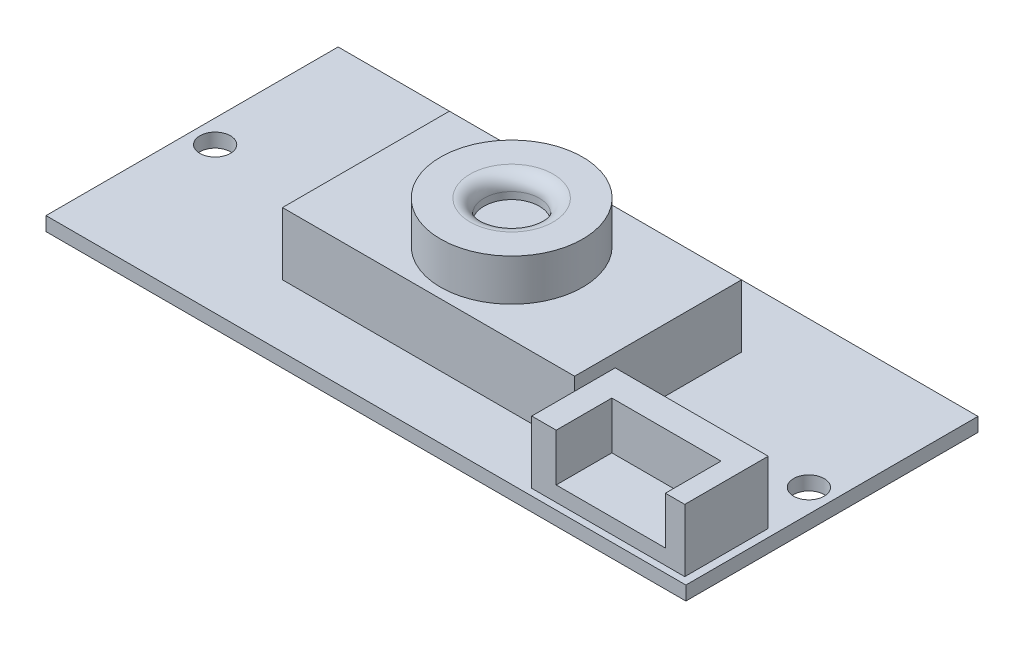
ISO-10303-21;
HEADER;
FILE_DESCRIPTION(('STEP AP214'),'2;1');
FILE_NAME('part.step','',(''),(''),'','','');
FILE_SCHEMA(('AUTOMOTIVE_DESIGN { 1 0 10303 214 1 1 1 1 }'));
ENDSEC;
DATA;
#1=APPLICATION_CONTEXT('core data for automotive mechanical design processes');
#2=APPLICATION_PROTOCOL_DEFINITION('international standard','automotive_design',2000,#1);
#3=PRODUCT_CONTEXT('',#1,'mechanical');
#4=PRODUCT('Part','Part','',(#3));
#5=PRODUCT_RELATED_PRODUCT_CATEGORY('part','',(#4));
#6=PRODUCT_DEFINITION_FORMATION('','',#4);
#7=PRODUCT_DEFINITION_CONTEXT('part definition',#1,'design');
#8=PRODUCT_DEFINITION('design','',#6,#7);
#9=PRODUCT_DEFINITION_SHAPE('','',#8);
#10=(LENGTH_UNIT() NAMED_UNIT(*) SI_UNIT(.MILLI.,.METRE.));
#11=(NAMED_UNIT(*) PLANE_ANGLE_UNIT() SI_UNIT($,.RADIAN.));
#12=(NAMED_UNIT(*) SI_UNIT($,.STERADIAN.) SOLID_ANGLE_UNIT());
#13=UNCERTAINTY_MEASURE_WITH_UNIT(LENGTH_MEASURE(1.E-05),#10,'distance_accuracy_value','');
#14=(GEOMETRIC_REPRESENTATION_CONTEXT(3) GLOBAL_UNCERTAINTY_ASSIGNED_CONTEXT((#13)) GLOBAL_UNIT_ASSIGNED_CONTEXT((#10,
#11,#12)) REPRESENTATION_CONTEXT('',''));
#15=CARTESIAN_POINT('',(0.,0.,0.));
#16=DIRECTION('',(0.,0.,1.));
#17=DIRECTION('',(1.,0.,0.));
#18=AXIS2_PLACEMENT_3D('',#15,#16,#17);
#19=CARTESIAN_POINT('',(0.,1.,0.));
#20=DIRECTION('',(0.,1.,0.));
#21=DIRECTION('',(0.,0.,1.));
#22=AXIS2_PLACEMENT_3D('',#19,#20,#21);
#23=PLANE('',#22);
#24=CARTESIAN_POINT('',(1.65816312177172,1.,10.5));
#25=DIRECTION('',(0.,1.,0.));
#26=DIRECTION('',(0.,0.,1.));
#27=AXIS2_PLACEMENT_3D('',#24,#25,#26);
#28=CIRCLE('',#27,1.1);
#29=CARTESIAN_POINT('',(1.65816312177172,1.,11.6));
#30=VERTEX_POINT('',#29);
#31=EDGE_CURVE('E290',#30,#30,#28,.T.);
#32=ORIENTED_EDGE('',*,*,#31,.F.);
#33=EDGE_LOOP('',(#32));
#34=FACE_BOUND('',#33,.T.);
#35=CARTESIAN_POINT('',(44.3418368782283,1.,10.5));
#36=DIRECTION('',(0.,1.,0.));
#37=DIRECTION('',(0.,0.,1.));
#38=AXIS2_PLACEMENT_3D('',#35,#36,#37);
#39=CIRCLE('',#38,1.1);
#40=CARTESIAN_POINT('',(44.3418368782283,1.,11.6));
#41=VERTEX_POINT('',#40);
#42=EDGE_CURVE('E296',#41,#41,#39,.T.);
#43=ORIENTED_EDGE('',*,*,#42,.F.);
#44=EDGE_LOOP('',(#43));
#45=FACE_BOUND('',#44,.T.);
#46=DIRECTION('',(0.,0.,1.));
#47=VECTOR('',#46,1.);
#48=CARTESIAN_POINT('',(12.5,1.,4.5));
#49=LINE('',#48,#47);
#50=CARTESIAN_POINT('',(12.5,1.,4.5));
#51=VERTEX_POINT('',#50);
#52=CARTESIAN_POINT('',(12.5,1.,16.5));
#53=VERTEX_POINT('',#52);
#54=EDGE_CURVE('E215',#51,#53,#49,.T.);
#55=ORIENTED_EDGE('',*,*,#54,.F.);
#56=DIRECTION('',(-1.,0.,0.));
#57=VECTOR('',#56,1.);
#58=CARTESIAN_POINT('',(12.5,1.,4.5));
#59=LINE('',#58,#57);
#60=CARTESIAN_POINT('',(33.5,1.,4.5));
#61=VERTEX_POINT('',#60);
#62=EDGE_CURVE('E229',#61,#51,#59,.T.);
#63=ORIENTED_EDGE('',*,*,#62,.F.);
#64=DIRECTION('',(0.,0.,-1.));
#65=VECTOR('',#64,1.);
#66=CARTESIAN_POINT('',(33.5,1.,4.5));
#67=LINE('',#66,#65);
#68=CARTESIAN_POINT('',(33.5,1.,16.5));
#69=VERTEX_POINT('',#68);
#70=EDGE_CURVE('E241',#69,#61,#67,.T.);
#71=ORIENTED_EDGE('',*,*,#70,.F.);
#72=DIRECTION('',(1.,0.,0.));
#73=VECTOR('',#72,1.);
#74=CARTESIAN_POINT('',(12.5,1.,16.5));
#75=LINE('',#74,#73);
#76=EDGE_CURVE('E238',#53,#69,#75,.T.);
#77=ORIENTED_EDGE('',*,*,#76,.F.);
#78=EDGE_LOOP('',(#55,#63,#71,#77));
#79=FACE_BOUND('',#78,.T.);
#80=DIRECTION('',(0.,0.,1.));
#81=VECTOR('',#80,1.);
#82=CARTESIAN_POINT('',(0.,1.,0.));
#83=LINE('',#82,#81);
#84=CARTESIAN_POINT('',(0.,1.,0.));
#85=VERTEX_POINT('',#84);
#86=CARTESIAN_POINT('',(0.,1.,21.));
#87=VERTEX_POINT('',#86);
#88=EDGE_CURVE('E258',#85,#87,#83,.T.);
#89=ORIENTED_EDGE('',*,*,#88,.T.);
#90=DIRECTION('',(1.,0.,0.));
#91=VECTOR('',#90,1.);
#92=CARTESIAN_POINT('',(0.,1.,21.));
#93=LINE('',#92,#91);
#94=CARTESIAN_POINT('',(46.,1.,21.));
#95=VERTEX_POINT('',#94);
#96=EDGE_CURVE('E261',#87,#95,#93,.T.);
#97=ORIENTED_EDGE('',*,*,#96,.T.);
#98=DIRECTION('',(0.,0.,-1.));
#99=VECTOR('',#98,1.);
#100=CARTESIAN_POINT('',(46.,1.,0.));
#101=LINE('',#100,#99);
#102=CARTESIAN_POINT('',(46.,1.,0.));
#103=VERTEX_POINT('',#102);
#104=EDGE_CURVE('E264',#95,#103,#101,.T.);
#105=ORIENTED_EDGE('',*,*,#104,.T.);
#106=DIRECTION('',(-1.,0.,0.));
#107=VECTOR('',#106,1.);
#108=CARTESIAN_POINT('',(0.,1.,0.));
#109=LINE('',#108,#107);
#110=EDGE_CURVE('E266',#103,#85,#109,.T.);
#111=ORIENTED_EDGE('',*,*,#110,.T.);
#112=EDGE_LOOP('',(#89,#97,#105,#111));
#113=FACE_BOUND('',#112,.T.);
#114=DIRECTION('',(1.,0.,0.));
#115=VECTOR('',#114,1.);
#116=CARTESIAN_POINT('',(34.4395808594965,1.,20.5204812635652));
#117=LINE('',#116,#115);
#118=CARTESIAN_POINT('',(34.4395808594965,1.,20.5204812635652));
#119=VERTEX_POINT('',#118);
#120=CARTESIAN_POINT('',(45.4395808594966,1.,20.5204812635652));
#121=VERTEX_POINT('',#120);
#122=EDGE_CURVE('E210',#119,#121,#117,.T.);
#123=ORIENTED_EDGE('',*,*,#122,.F.);
#124=DIRECTION('',(0.,0.,1.));
#125=VECTOR('',#124,1.);
#126=CARTESIAN_POINT('',(34.4395808594965,1.,14.5204812635652));
#127=LINE('',#126,#125);
#128=CARTESIAN_POINT('',(34.4395808594965,1.,14.5204812635652));
#129=VERTEX_POINT('',#128);
#130=EDGE_CURVE('E212',#129,#119,#127,.T.);
#131=ORIENTED_EDGE('',*,*,#130,.F.);
#132=DIRECTION('',(-1.,0.,0.));
#133=VECTOR('',#132,1.);
#134=CARTESIAN_POINT('',(34.4395808594965,1.,14.5204812635652));
#135=LINE('',#134,#133);
#136=CARTESIAN_POINT('',(45.4395808594966,1.,14.5204812635652));
#137=VERTEX_POINT('',#136);
#138=EDGE_CURVE('E205',#137,#129,#135,.T.);
#139=ORIENTED_EDGE('',*,*,#138,.F.);
#140=DIRECTION('',(0.,0.,-1.));
#141=VECTOR('',#140,1.);
#142=CARTESIAN_POINT('',(45.4395808594966,1.,14.5204812635652));
#143=LINE('',#142,#141);
#144=EDGE_CURVE('E207',#121,#137,#143,.T.);
#145=ORIENTED_EDGE('',*,*,#144,.F.);
#146=EDGE_LOOP('',(#123,#131,#139,#145));
#147=FACE_BOUND('',#146,.T.);
#148=ADVANCED_FACE('F40',(#34,#45,#79,#113,#147),#23,.T.);
#149=CARTESIAN_POINT('',(0.,1.,0.));
#150=DIRECTION('',(1.,0.,0.));
#151=DIRECTION('',(0.,0.,-1.));
#152=AXIS2_PLACEMENT_3D('',#149,#150,#151);
#153=PLANE('',#152);
#154=DIRECTION('',(0.,0.,1.));
#155=VECTOR('',#154,1.);
#156=CARTESIAN_POINT('',(0.,0.,0.));
#157=LINE('',#156,#155);
#158=CARTESIAN_POINT('',(0.,0.,0.));
#159=VERTEX_POINT('',#158);
#160=CARTESIAN_POINT('',(0.,0.,21.));
#161=VERTEX_POINT('',#160);
#162=EDGE_CURVE('E257',#159,#161,#157,.T.);
#163=ORIENTED_EDGE('',*,*,#162,.T.);
#164=DIRECTION('',(0.,-1.,0.));
#165=VECTOR('',#164,1.);
#166=CARTESIAN_POINT('',(0.,1.,21.));
#167=LINE('',#166,#165);
#168=EDGE_CURVE('E284',#87,#161,#167,.T.);
#169=ORIENTED_EDGE('',*,*,#168,.F.);
#170=ORIENTED_EDGE('',*,*,#88,.F.);
#171=DIRECTION('',(0.,-1.,0.));
#172=VECTOR('',#171,1.);
#173=CARTESIAN_POINT('',(0.,1.,0.));
#174=LINE('',#173,#172);
#175=EDGE_CURVE('E268',#85,#159,#174,.T.);
#176=ORIENTED_EDGE('',*,*,#175,.T.);
#177=EDGE_LOOP('',(#163,#169,#170,#176));
#178=FACE_BOUND('',#177,.T.);
#179=ADVANCED_FACE('F339',(#178),#153,.F.);
#180=CARTESIAN_POINT('',(0.,1.,21.));
#181=DIRECTION('',(0.,0.,-1.));
#182=DIRECTION('',(-1.,0.,0.));
#183=AXIS2_PLACEMENT_3D('',#180,#181,#182);
#184=PLANE('',#183);
#185=DIRECTION('',(1.,0.,0.));
#186=VECTOR('',#185,1.);
#187=CARTESIAN_POINT('',(0.,0.,21.));
#188=LINE('',#187,#186);
#189=CARTESIAN_POINT('',(46.,0.,21.));
#190=VERTEX_POINT('',#189);
#191=EDGE_CURVE('E271',#161,#190,#188,.T.);
#192=ORIENTED_EDGE('',*,*,#191,.T.);
#193=DIRECTION('',(0.,-1.,0.));
#194=VECTOR('',#193,1.);
#195=CARTESIAN_POINT('',(46.,1.,21.));
#196=LINE('',#195,#194);
#197=EDGE_CURVE('E281',#95,#190,#196,.T.);
#198=ORIENTED_EDGE('',*,*,#197,.F.);
#199=ORIENTED_EDGE('',*,*,#96,.F.);
#200=ORIENTED_EDGE('',*,*,#168,.T.);
#201=EDGE_LOOP('',(#192,#198,#199,#200));
#202=FACE_BOUND('',#201,.T.);
#203=ADVANCED_FACE('F395',(#202),#184,.F.);
#204=CARTESIAN_POINT('',(46.,1.,0.));
#205=DIRECTION('',(-1.,0.,0.));
#206=DIRECTION('',(0.,0.,1.));
#207=AXIS2_PLACEMENT_3D('',#204,#205,#206);
#208=PLANE('',#207);
#209=DIRECTION('',(0.,0.,-1.));
#210=VECTOR('',#209,1.);
#211=CARTESIAN_POINT('',(46.,0.,0.));
#212=LINE('',#211,#210);
#213=CARTESIAN_POINT('',(46.,0.,0.));
#214=VERTEX_POINT('',#213);
#215=EDGE_CURVE('E273',#190,#214,#212,.T.);
#216=ORIENTED_EDGE('',*,*,#215,.T.);
#217=DIRECTION('',(0.,-1.,0.));
#218=VECTOR('',#217,1.);
#219=CARTESIAN_POINT('',(46.,1.,0.));
#220=LINE('',#219,#218);
#221=EDGE_CURVE('E278',#103,#214,#220,.T.);
#222=ORIENTED_EDGE('',*,*,#221,.F.);
#223=ORIENTED_EDGE('',*,*,#104,.F.);
#224=ORIENTED_EDGE('',*,*,#197,.T.);
#225=EDGE_LOOP('',(#216,#222,#223,#224));
#226=FACE_BOUND('',#225,.T.);
#227=ADVANCED_FACE('F391',(#226),#208,.F.);
#228=CARTESIAN_POINT('',(0.,1.,0.));
#229=DIRECTION('',(0.,0.,1.));
#230=DIRECTION('',(1.,0.,0.));
#231=AXIS2_PLACEMENT_3D('',#228,#229,#230);
#232=PLANE('',#231);
#233=DIRECTION('',(-1.,0.,0.));
#234=VECTOR('',#233,1.);
#235=CARTESIAN_POINT('',(0.,0.,0.));
#236=LINE('',#235,#234);
#237=EDGE_CURVE('E262',#214,#159,#236,.T.);
#238=ORIENTED_EDGE('',*,*,#237,.T.);
#239=ORIENTED_EDGE('',*,*,#175,.F.);
#240=ORIENTED_EDGE('',*,*,#110,.F.);
#241=ORIENTED_EDGE('',*,*,#221,.T.);
#242=EDGE_LOOP('',(#238,#239,#240,#241));
#243=FACE_BOUND('',#242,.T.);
#244=ADVANCED_FACE('F387',(#243),#232,.F.);
#245=CARTESIAN_POINT('',(0.,0.,0.));
#246=DIRECTION('',(0.,1.,0.));
#247=DIRECTION('',(0.,0.,1.));
#248=AXIS2_PLACEMENT_3D('',#245,#246,#247);
#249=PLANE('',#248);
#250=CARTESIAN_POINT('',(1.65816312177172,0.,10.5));
#251=DIRECTION('',(0.,1.,0.));
#252=DIRECTION('',(0.,0.,1.));
#253=AXIS2_PLACEMENT_3D('',#250,#251,#252);
#254=CIRCLE('',#253,1.1);
#255=CARTESIAN_POINT('',(1.65816312177172,0.,11.6));
#256=VERTEX_POINT('',#255);
#257=EDGE_CURVE('E44',#256,#256,#254,.T.);
#258=ORIENTED_EDGE('',*,*,#257,.T.);
#259=EDGE_LOOP('',(#258));
#260=FACE_BOUND('',#259,.T.);
#261=CARTESIAN_POINT('',(44.3418368782283,0.,10.5));
#262=DIRECTION('',(0.,1.,0.));
#263=DIRECTION('',(0.,0.,1.));
#264=AXIS2_PLACEMENT_3D('',#261,#262,#263);
#265=CIRCLE('',#264,1.1);
#266=CARTESIAN_POINT('',(44.3418368782283,0.,11.6));
#267=VERTEX_POINT('',#266);
#268=EDGE_CURVE('E288',#267,#267,#265,.T.);
#269=ORIENTED_EDGE('',*,*,#268,.T.);
#270=EDGE_LOOP('',(#269));
#271=FACE_BOUND('',#270,.T.);
#272=ORIENTED_EDGE('',*,*,#162,.F.);
#273=ORIENTED_EDGE('',*,*,#237,.F.);
#274=ORIENTED_EDGE('',*,*,#215,.F.);
#275=ORIENTED_EDGE('',*,*,#191,.F.);
#276=EDGE_LOOP('',(#272,#273,#274,#275));
#277=FACE_BOUND('',#276,.T.);
#278=ADVANCED_FACE('F383',(#260,#271,#277),#249,.F.);
#279=CARTESIAN_POINT('',(12.5,5.5,4.5));
#280=DIRECTION('',(1.,0.,0.));
#281=DIRECTION('',(0.,0.,-1.));
#282=AXIS2_PLACEMENT_3D('',#279,#280,#281);
#283=PLANE('',#282);
#284=ORIENTED_EDGE('',*,*,#54,.T.);
#285=DIRECTION('',(0.,-1.,0.));
#286=VECTOR('',#285,1.);
#287=CARTESIAN_POINT('',(12.5,5.5,16.5));
#288=LINE('',#287,#286);
#289=CARTESIAN_POINT('',(12.5,5.5,16.5));
#290=VERTEX_POINT('',#289);
#291=EDGE_CURVE('E254',#290,#53,#288,.T.);
#292=ORIENTED_EDGE('',*,*,#291,.F.);
#293=DIRECTION('',(0.,0.,1.));
#294=VECTOR('',#293,1.);
#295=CARTESIAN_POINT('',(12.5,5.5,4.5));
#296=LINE('',#295,#294);
#297=CARTESIAN_POINT('',(12.5,5.5,4.5));
#298=VERTEX_POINT('',#297);
#299=EDGE_CURVE('E225',#298,#290,#296,.T.);
#300=ORIENTED_EDGE('',*,*,#299,.F.);
#301=DIRECTION('',(0.,-1.,0.));
#302=VECTOR('',#301,1.);
#303=CARTESIAN_POINT('',(12.5,5.5,4.5));
#304=LINE('',#303,#302);
#305=EDGE_CURVE('E235',#298,#51,#304,.T.);
#306=ORIENTED_EDGE('',*,*,#305,.T.);
#307=EDGE_LOOP('',(#284,#292,#300,#306));
#308=FACE_BOUND('',#307,.T.);
#309=ADVANCED_FACE('F328',(#308),#283,.F.);
#310=CARTESIAN_POINT('',(12.5,5.5,16.5));
#311=DIRECTION('',(0.,0.,-1.));
#312=DIRECTION('',(-1.,0.,0.));
#313=AXIS2_PLACEMENT_3D('',#310,#311,#312);
#314=PLANE('',#313);
#315=ORIENTED_EDGE('',*,*,#76,.T.);
#316=DIRECTION('',(0.,-1.,0.));
#317=VECTOR('',#316,1.);
#318=CARTESIAN_POINT('',(33.5,5.5,16.5));
#319=LINE('',#318,#317);
#320=CARTESIAN_POINT('',(33.5,5.5,16.5));
#321=VERTEX_POINT('',#320);
#322=EDGE_CURVE('E251',#321,#69,#319,.T.);
#323=ORIENTED_EDGE('',*,*,#322,.F.);
#324=DIRECTION('',(1.,0.,0.));
#325=VECTOR('',#324,1.);
#326=CARTESIAN_POINT('',(12.5,5.5,16.5));
#327=LINE('',#326,#325);
#328=EDGE_CURVE('E228',#290,#321,#327,.T.);
#329=ORIENTED_EDGE('',*,*,#328,.F.);
#330=ORIENTED_EDGE('',*,*,#291,.T.);
#331=EDGE_LOOP('',(#315,#323,#329,#330));
#332=FACE_BOUND('',#331,.T.);
#333=ADVANCED_FACE('F330',(#332),#314,.F.);
#334=CARTESIAN_POINT('',(33.5,5.5,4.5));
#335=DIRECTION('',(-1.,0.,0.));
#336=DIRECTION('',(0.,0.,1.));
#337=AXIS2_PLACEMENT_3D('',#334,#335,#336);
#338=PLANE('',#337);
#339=ORIENTED_EDGE('',*,*,#70,.T.);
#340=DIRECTION('',(0.,-1.,0.));
#341=VECTOR('',#340,1.);
#342=CARTESIAN_POINT('',(33.5,5.5,4.5));
#343=LINE('',#342,#341);
#344=CARTESIAN_POINT('',(33.5,5.5,4.5));
#345=VERTEX_POINT('',#344);
#346=EDGE_CURVE('E248',#345,#61,#343,.T.);
#347=ORIENTED_EDGE('',*,*,#346,.F.);
#348=DIRECTION('',(0.,0.,-1.));
#349=VECTOR('',#348,1.);
#350=CARTESIAN_POINT('',(33.5,5.5,4.5));
#351=LINE('',#350,#349);
#352=EDGE_CURVE('E231',#321,#345,#351,.T.);
#353=ORIENTED_EDGE('',*,*,#352,.F.);
#354=ORIENTED_EDGE('',*,*,#322,.T.);
#355=EDGE_LOOP('',(#339,#347,#353,#354));
#356=FACE_BOUND('',#355,.T.);
#357=ADVANCED_FACE('F334',(#356),#338,.F.);
#358=CARTESIAN_POINT('',(12.5,5.5,4.5));
#359=DIRECTION('',(0.,0.,1.));
#360=DIRECTION('',(1.,0.,0.));
#361=AXIS2_PLACEMENT_3D('',#358,#359,#360);
#362=PLANE('',#361);
#363=ORIENTED_EDGE('',*,*,#62,.T.);
#364=ORIENTED_EDGE('',*,*,#305,.F.);
#365=DIRECTION('',(-1.,0.,0.));
#366=VECTOR('',#365,1.);
#367=CARTESIAN_POINT('',(12.5,5.5,4.5));
#368=LINE('',#367,#366);
#369=EDGE_CURVE('E233',#345,#298,#368,.T.);
#370=ORIENTED_EDGE('',*,*,#369,.F.);
#371=ORIENTED_EDGE('',*,*,#346,.T.);
#372=EDGE_LOOP('',(#363,#364,#370,#371));
#373=FACE_BOUND('',#372,.T.);
#374=ADVANCED_FACE('F320',(#373),#362,.F.);
#375=CARTESIAN_POINT('',(0.,5.5,0.));
#376=DIRECTION('',(0.,1.,0.));
#377=DIRECTION('',(0.,0.,1.));
#378=AXIS2_PLACEMENT_3D('',#375,#376,#377);
#379=PLANE('',#378);
#380=CARTESIAN_POINT('',(23.1471850819188,5.5,10.6717159289053));
#381=DIRECTION('',(0.,1.,0.));
#382=DIRECTION('',(0.,0.,1.));
#383=AXIS2_PLACEMENT_3D('',#380,#381,#382);
#384=CIRCLE('',#383,5.10925192655788);
#385=CARTESIAN_POINT('',(23.1471850819188,5.5,15.7809678554631));
#386=VERTEX_POINT('',#385);
#387=EDGE_CURVE('E181',#386,#386,#384,.T.);
#388=ORIENTED_EDGE('',*,*,#387,.F.);
#389=EDGE_LOOP('',(#388));
#390=FACE_BOUND('',#389,.T.);
#391=ORIENTED_EDGE('',*,*,#299,.T.);
#392=ORIENTED_EDGE('',*,*,#328,.T.);
#393=ORIENTED_EDGE('',*,*,#352,.T.);
#394=ORIENTED_EDGE('',*,*,#369,.T.);
#395=EDGE_LOOP('',(#391,#392,#393,#394));
#396=FACE_BOUND('',#395,.T.);
#397=ADVANCED_FACE('F316',(#390,#396),#379,.T.);
#398=CARTESIAN_POINT('',(34.4395808594965,5.5,14.5204812635652));
#399=DIRECTION('',(1.,0.,0.));
#400=DIRECTION('',(0.,0.,-1.));
#401=AXIS2_PLACEMENT_3D('',#398,#399,#400);
#402=PLANE('',#401);
#403=ORIENTED_EDGE('',*,*,#130,.T.);
#404=DIRECTION('',(0.,-1.,0.));
#405=VECTOR('',#404,1.);
#406=CARTESIAN_POINT('',(34.4395808594965,5.5,20.5204812635652));
#407=LINE('',#406,#405);
#408=CARTESIAN_POINT('',(34.4395808594965,5.5,20.5204812635652));
#409=VERTEX_POINT('',#408);
#410=EDGE_CURVE('E191',#409,#119,#407,.T.);
#411=ORIENTED_EDGE('',*,*,#410,.F.);
#412=DIRECTION('',(0.,0.,1.));
#413=VECTOR('',#412,1.);
#414=CARTESIAN_POINT('',(34.4395808594965,5.5,14.5204812635652));
#415=LINE('',#414,#413);
#416=CARTESIAN_POINT('',(34.4395808594965,5.5,14.5204812635652));
#417=VERTEX_POINT('',#416);
#418=EDGE_CURVE('E208',#417,#409,#415,.T.);
#419=ORIENTED_EDGE('',*,*,#418,.F.);
#420=DIRECTION('',(0.,-1.,0.));
#421=VECTOR('',#420,1.);
#422=CARTESIAN_POINT('',(34.4395808594965,5.5,14.5204812635652));
#423=LINE('',#422,#421);
#424=EDGE_CURVE('E201',#417,#129,#423,.T.);
#425=ORIENTED_EDGE('',*,*,#424,.T.);
#426=EDGE_LOOP('',(#403,#411,#419,#425));
#427=FACE_BOUND('',#426,.T.);
#428=ADVANCED_FACE('F319',(#427),#402,.F.);
#429=CARTESIAN_POINT('',(34.4395808594965,5.5,20.5204812635652));
#430=DIRECTION('',(0.,0.,-1.));
#431=DIRECTION('',(-1.,0.,0.));
#432=AXIS2_PLACEMENT_3D('',#429,#430,#431);
#433=PLANE('',#432);
#434=DIRECTION('',(1.,0.,0.));
#435=VECTOR('',#434,1.);
#436=CARTESIAN_POINT('',(36.1975956787205,2.0876671313654,20.5204812635652));
#437=LINE('',#436,#435);
#438=CARTESIAN_POINT('',(36.1975956787205,2.0876671313654,20.5204812635652));
#439=VERTEX_POINT('',#438);
#440=CARTESIAN_POINT('',(44.0474667143907,2.0876671313654,20.5204812635652));
#441=VERTEX_POINT('',#440);
#442=EDGE_CURVE('E178',#439,#441,#437,.T.);
#443=ORIENTED_EDGE('',*,*,#442,.F.);
#444=DIRECTION('',(0.,-1.,0.));
#445=VECTOR('',#444,1.);
#446=CARTESIAN_POINT('',(36.1975956787205,5.5,20.5204812635652));
#447=LINE('',#446,#445);
#448=CARTESIAN_POINT('',(36.1975956787205,5.5,20.5204812635652));
#449=VERTEX_POINT('',#448);
#450=EDGE_CURVE('E163',#449,#439,#447,.T.);
#451=ORIENTED_EDGE('',*,*,#450,.F.);
#452=DIRECTION('',(1.,0.,0.));
#453=VECTOR('',#452,1.);
#454=CARTESIAN_POINT('',(34.4395808594965,5.5,20.5204812635652));
#455=LINE('',#454,#453);
#456=EDGE_CURVE('E220',#409,#449,#455,.T.);
#457=ORIENTED_EDGE('',*,*,#456,.F.);
#458=ORIENTED_EDGE('',*,*,#410,.T.);
#459=ORIENTED_EDGE('',*,*,#122,.T.);
#460=DIRECTION('',(0.,-1.,0.));
#461=VECTOR('',#460,1.);
#462=CARTESIAN_POINT('',(45.4395808594966,5.5,20.5204812635652));
#463=LINE('',#462,#461);
#464=CARTESIAN_POINT('',(45.4395808594966,5.5,20.5204812635652));
#465=VERTEX_POINT('',#464);
#466=EDGE_CURVE('E197',#465,#121,#463,.T.);
#467=ORIENTED_EDGE('',*,*,#466,.F.);
#468=CARTESIAN_POINT('',(44.0474667143907,5.5,20.5204812635652));
#469=VERTEX_POINT('',#468);
#470=EDGE_CURVE('E219',#469,#465,#455,.T.);
#471=ORIENTED_EDGE('',*,*,#470,.F.);
#472=DIRECTION('',(0.,1.,0.));
#473=VECTOR('',#472,1.);
#474=CARTESIAN_POINT('',(44.0474667143907,5.5,20.5204812635652));
#475=LINE('',#474,#473);
#476=EDGE_CURVE('E176',#441,#469,#475,.T.);
#477=ORIENTED_EDGE('',*,*,#476,.F.);
#478=EDGE_LOOP('',(#443,#451,#457,#458,#459,#467,#471,#477));
#479=FACE_BOUND('',#478,.T.);
#480=ADVANCED_FACE('F351',(#479),#433,.F.);
#481=CARTESIAN_POINT('',(45.4395808594966,5.5,14.5204812635652));
#482=DIRECTION('',(-1.,0.,0.));
#483=DIRECTION('',(0.,0.,1.));
#484=AXIS2_PLACEMENT_3D('',#481,#482,#483);
#485=PLANE('',#484);
#486=ORIENTED_EDGE('',*,*,#144,.T.);
#487=DIRECTION('',(0.,-1.,0.));
#488=VECTOR('',#487,1.);
#489=CARTESIAN_POINT('',(45.4395808594966,5.5,14.5204812635652));
#490=LINE('',#489,#488);
#491=CARTESIAN_POINT('',(45.4395808594966,5.5,14.5204812635652));
#492=VERTEX_POINT('',#491);
#493=EDGE_CURVE('E65',#492,#137,#490,.T.);
#494=ORIENTED_EDGE('',*,*,#493,.F.);
#495=DIRECTION('',(0.,0.,-1.));
#496=VECTOR('',#495,1.);
#497=CARTESIAN_POINT('',(45.4395808594966,5.5,14.5204812635652));
#498=LINE('',#497,#496);
#499=EDGE_CURVE('E217',#465,#492,#498,.T.);
#500=ORIENTED_EDGE('',*,*,#499,.F.);
#501=ORIENTED_EDGE('',*,*,#466,.T.);
#502=EDGE_LOOP('',(#486,#494,#500,#501));
#503=FACE_BOUND('',#502,.T.);
#504=ADVANCED_FACE('F356',(#503),#485,.F.);
#505=CARTESIAN_POINT('',(34.4395808594965,5.5,14.5204812635652));
#506=DIRECTION('',(0.,0.,1.));
#507=DIRECTION('',(1.,0.,0.));
#508=AXIS2_PLACEMENT_3D('',#505,#506,#507);
#509=PLANE('',#508);
#510=ORIENTED_EDGE('',*,*,#138,.T.);
#511=ORIENTED_EDGE('',*,*,#424,.F.);
#512=DIRECTION('',(-1.,0.,0.));
#513=VECTOR('',#512,1.);
#514=CARTESIAN_POINT('',(34.4395808594965,5.5,14.5204812635652));
#515=LINE('',#514,#513);
#516=EDGE_CURVE('E204',#492,#417,#515,.T.);
#517=ORIENTED_EDGE('',*,*,#516,.F.);
#518=ORIENTED_EDGE('',*,*,#493,.T.);
#519=EDGE_LOOP('',(#510,#511,#517,#518));
#520=FACE_BOUND('',#519,.T.);
#521=ADVANCED_FACE('F365',(#520),#509,.F.);
#522=CARTESIAN_POINT('',(0.,5.5,0.));
#523=DIRECTION('',(0.,1.,0.));
#524=DIRECTION('',(0.,0.,1.));
#525=AXIS2_PLACEMENT_3D('',#522,#523,#524);
#526=PLANE('',#525);
#527=DIRECTION('',(0.,0.,1.));
#528=VECTOR('',#527,1.);
#529=CARTESIAN_POINT('',(36.1975956787205,5.5,16.5204812635652));
#530=LINE('',#529,#528);
#531=CARTESIAN_POINT('',(36.1975956787205,5.5,16.5204812635652));
#532=VERTEX_POINT('',#531);
#533=EDGE_CURVE('E189',#532,#449,#530,.T.);
#534=ORIENTED_EDGE('',*,*,#533,.F.);
#535=DIRECTION('',(-1.,0.,0.));
#536=VECTOR('',#535,1.);
#537=CARTESIAN_POINT('',(36.1975956787205,5.5,16.5204812635652));
#538=LINE('',#537,#536);
#539=CARTESIAN_POINT('',(44.0474667143907,5.5,16.5204812635652));
#540=VERTEX_POINT('',#539);
#541=EDGE_CURVE('E168',#540,#532,#538,.T.);
#542=ORIENTED_EDGE('',*,*,#541,.F.);
#543=DIRECTION('',(0.,0.,1.));
#544=VECTOR('',#543,1.);
#545=CARTESIAN_POINT('',(44.0474667143907,5.5,16.5204812635652));
#546=LINE('',#545,#544);
#547=EDGE_CURVE('E192',#540,#469,#546,.T.);
#548=ORIENTED_EDGE('',*,*,#547,.T.);
#549=ORIENTED_EDGE('',*,*,#470,.T.);
#550=ORIENTED_EDGE('',*,*,#499,.T.);
#551=ORIENTED_EDGE('',*,*,#516,.T.);
#552=ORIENTED_EDGE('',*,*,#418,.T.);
#553=ORIENTED_EDGE('',*,*,#456,.T.);
#554=EDGE_LOOP('',(#534,#542,#548,#549,#550,#551,#552,#553));
#555=FACE_BOUND('',#554,.T.);
#556=ADVANCED_FACE('F358',(#555),#526,.T.);
#557=CARTESIAN_POINT('',(36.1975956787205,5.5,16.5204812635652));
#558=DIRECTION('',(-1.,0.,0.));
#559=DIRECTION('',(0.,0.,1.));
#560=AXIS2_PLACEMENT_3D('',#557,#558,#559);
#561=PLANE('',#560);
#562=ORIENTED_EDGE('',*,*,#450,.T.);
#563=DIRECTION('',(0.,0.,1.));
#564=VECTOR('',#563,1.);
#565=CARTESIAN_POINT('',(36.1975956787205,2.0876671313654,16.5204812635652));
#566=LINE('',#565,#564);
#567=CARTESIAN_POINT('',(36.1975956787205,2.0876671313654,16.5204812635652));
#568=VERTEX_POINT('',#567);
#569=EDGE_CURVE('E157',#568,#439,#566,.T.);
#570=ORIENTED_EDGE('',*,*,#569,.F.);
#571=DIRECTION('',(0.,-1.,0.));
#572=VECTOR('',#571,1.);
#573=CARTESIAN_POINT('',(36.1975956787205,5.5,16.5204812635652));
#574=LINE('',#573,#572);
#575=EDGE_CURVE('E161',#532,#568,#574,.T.);
#576=ORIENTED_EDGE('',*,*,#575,.F.);
#577=ORIENTED_EDGE('',*,*,#533,.T.);
#578=EDGE_LOOP('',(#562,#570,#576,#577));
#579=FACE_BOUND('',#578,.T.);
#580=ADVANCED_FACE('F159',(#579),#561,.F.);
#581=CARTESIAN_POINT('',(44.0474667143907,5.5,16.5204812635652));
#582=DIRECTION('',(1.,0.,0.));
#583=DIRECTION('',(0.,0.,-1.));
#584=AXIS2_PLACEMENT_3D('',#581,#582,#583);
#585=PLANE('',#584);
#586=ORIENTED_EDGE('',*,*,#476,.T.);
#587=ORIENTED_EDGE('',*,*,#547,.F.);
#588=DIRECTION('',(0.,1.,0.));
#589=VECTOR('',#588,1.);
#590=CARTESIAN_POINT('',(44.0474667143907,5.5,16.5204812635652));
#591=LINE('',#590,#589);
#592=CARTESIAN_POINT('',(44.0474667143907,2.0876671313654,16.5204812635652));
#593=VERTEX_POINT('',#592);
#594=EDGE_CURVE('E57',#593,#540,#591,.T.);
#595=ORIENTED_EDGE('',*,*,#594,.F.);
#596=DIRECTION('',(0.,0.,1.));
#597=VECTOR('',#596,1.);
#598=CARTESIAN_POINT('',(44.0474667143907,2.0876671313654,16.5204812635652));
#599=LINE('',#598,#597);
#600=EDGE_CURVE('E167',#593,#441,#599,.T.);
#601=ORIENTED_EDGE('',*,*,#600,.T.);
#602=EDGE_LOOP('',(#586,#587,#595,#601));
#603=FACE_BOUND('',#602,.T.);
#604=ADVANCED_FACE('F362',(#603),#585,.F.);
#605=CARTESIAN_POINT('',(36.1975956787205,2.0876671313654,16.5204812635652));
#606=DIRECTION('',(0.,-1.,0.));
#607=DIRECTION('',(0.,0.,-1.));
#608=AXIS2_PLACEMENT_3D('',#605,#606,#607);
#609=PLANE('',#608);
#610=ORIENTED_EDGE('',*,*,#442,.T.);
#611=ORIENTED_EDGE('',*,*,#600,.F.);
#612=DIRECTION('',(1.,0.,0.));
#613=VECTOR('',#612,1.);
#614=CARTESIAN_POINT('',(36.1975956787205,2.0876671313654,16.5204812635652));
#615=LINE('',#614,#613);
#616=EDGE_CURVE('E170',#568,#593,#615,.T.);
#617=ORIENTED_EDGE('',*,*,#616,.F.);
#618=ORIENTED_EDGE('',*,*,#569,.T.);
#619=EDGE_LOOP('',(#610,#611,#617,#618));
#620=FACE_BOUND('',#619,.T.);
#621=ADVANCED_FACE('F171',(#620),#609,.F.);
#622=CARTESIAN_POINT('',(0.,0.,16.5204812635652));
#623=DIRECTION('',(0.,0.,1.));
#624=DIRECTION('',(1.,0.,0.));
#625=AXIS2_PLACEMENT_3D('',#622,#623,#624);
#626=PLANE('',#625);
#627=ORIENTED_EDGE('',*,*,#575,.T.);
#628=ORIENTED_EDGE('',*,*,#616,.T.);
#629=ORIENTED_EDGE('',*,*,#594,.T.);
#630=ORIENTED_EDGE('',*,*,#541,.T.);
#631=EDGE_LOOP('',(#627,#628,#629,#630));
#632=FACE_BOUND('',#631,.T.);
#633=ADVANCED_FACE('F173',(#632),#626,.T.);
#634=CARTESIAN_POINT('',(23.1471850819188,8.5,10.6717159289053));
#635=DIRECTION('',(0.,-1.,0.));
#636=DIRECTION('',(0.,0.,-1.));
#637=AXIS2_PLACEMENT_3D('',#634,#635,#636);
#638=CYLINDRICAL_SURFACE('',#637,5.10925192655788);
#639=CARTESIAN_POINT('',(23.1471850819188,8.5,10.6717159289053));
#640=DIRECTION('',(0.,1.,0.));
#641=DIRECTION('',(0.,0.,1.));
#642=AXIS2_PLACEMENT_3D('',#639,#640,#641);
#643=CIRCLE('',#642,5.10925192655788);
#644=CARTESIAN_POINT('',(23.1471850819188,8.5,15.7809678554631));
#645=VERTEX_POINT('',#644);
#646=EDGE_CURVE('E187',#645,#645,#643,.T.);
#647=ORIENTED_EDGE('',*,*,#646,.F.);
#648=EDGE_LOOP('',(#647));
#649=FACE_BOUND('',#648,.T.);
#650=ORIENTED_EDGE('',*,*,#387,.T.);
#651=EDGE_LOOP('',(#650));
#652=FACE_BOUND('',#651,.T.);
#653=ADVANCED_FACE('F309',(#649,#652),#638,.T.);
#654=CARTESIAN_POINT('',(23.1471850819188,8.5,10.6717159289053));
#655=DIRECTION('',(0.,1.,0.));
#656=DIRECTION('',(0.,0.,1.));
#657=AXIS2_PLACEMENT_3D('',#654,#655,#656);
#658=PLANE('',#657);
#659=CARTESIAN_POINT('',(23.1471850819188,8.5,10.6717159289053));
#660=DIRECTION('',(0.,1.,0.));
#661=DIRECTION('',(0.,0.,1.));
#662=AXIS2_PLACEMENT_3D('',#659,#660,#661);
#663=CIRCLE('',#662,2.98684717515229);
#664=CARTESIAN_POINT('',(23.1471850819188,8.5,13.6585631040576));
#665=VERTEX_POINT('',#664);
#666=EDGE_CURVE('E11',#665,#665,#663,.F.);
#667=ORIENTED_EDGE('',*,*,#666,.T.);
#668=EDGE_LOOP('',(#667));
#669=FACE_BOUND('',#668,.T.);
#670=ORIENTED_EDGE('',*,*,#646,.T.);
#671=EDGE_LOOP('',(#670));
#672=FACE_BOUND('',#671,.T.);
#673=ADVANCED_FACE('F307',(#669,#672),#658,.T.);
#674=CARTESIAN_POINT('',(23.1471850819188,7.,10.6717159289053));
#675=DIRECTION('',(0.,1.,0.));
#676=DIRECTION('',(0.,0.,1.));
#677=AXIS2_PLACEMENT_3D('',#674,#675,#676);
#678=CYLINDRICAL_SURFACE('',#677,1.98684717515229);
#679=CARTESIAN_POINT('',(23.1471850819188,7.5,10.6717159289053));
#680=DIRECTION('',(0.,1.,0.));
#681=DIRECTION('',(0.,0.,1.));
#682=AXIS2_PLACEMENT_3D('',#679,#680,#681);
#683=CIRCLE('',#682,1.98684717515229);
#684=CARTESIAN_POINT('',(23.1471850819188,7.5,12.6585631040576));
#685=VERTEX_POINT('',#684);
#686=EDGE_CURVE('E49',#685,#685,#683,.T.);
#687=ORIENTED_EDGE('',*,*,#686,.T.);
#688=EDGE_LOOP('',(#687));
#689=FACE_BOUND('',#688,.T.);
#690=CARTESIAN_POINT('',(23.1471850819188,7.,10.6717159289053));
#691=DIRECTION('',(0.,1.,0.));
#692=DIRECTION('',(0.,0.,1.));
#693=AXIS2_PLACEMENT_3D('',#690,#691,#692);
#694=CIRCLE('',#693,1.98684717515229);
#695=CARTESIAN_POINT('',(23.1471850819188,7.,12.6585631040576));
#696=VERTEX_POINT('',#695);
#697=EDGE_CURVE('E294',#696,#696,#694,.T.);
#698=ORIENTED_EDGE('',*,*,#697,.F.);
#699=EDGE_LOOP('',(#698));
#700=FACE_BOUND('',#699,.T.);
#701=ADVANCED_FACE('F489',(#689,#700),#678,.F.);
#702=CARTESIAN_POINT('',(23.1471850819188,7.,10.6717159289053));
#703=DIRECTION('',(0.,1.,0.));
#704=DIRECTION('',(0.,0.,1.));
#705=AXIS2_PLACEMENT_3D('',#702,#703,#704);
#706=PLANE('',#705);
#707=ORIENTED_EDGE('',*,*,#697,.T.);
#708=EDGE_LOOP('',(#707));
#709=FACE_BOUND('',#708,.T.);
#710=ADVANCED_FACE('F484',(#709),#706,.T.);
#711=CARTESIAN_POINT('',(23.1471850819188,7.5,10.6717159289053));
#712=DIRECTION('',(0.,1.,0.));
#713=DIRECTION('',(0.,0.,1.));
#714=AXIS2_PLACEMENT_3D('',#711,#712,#713);
#715=TOROIDAL_SURFACE('',#714,2.98684717515229,1.);
#716=ORIENTED_EDGE('',*,*,#666,.F.);
#717=EDGE_LOOP('',(#716));
#718=FACE_BOUND('',#717,.T.);
#719=ORIENTED_EDGE('',*,*,#686,.F.);
#720=EDGE_LOOP('',(#719));
#721=FACE_BOUND('',#720,.T.);
#722=ADVANCED_FACE('F42',(#718,#721),#715,.T.);
#723=CARTESIAN_POINT('',(44.3418368782283,-0.5,10.5));
#724=DIRECTION('',(0.,1.,0.));
#725=DIRECTION('',(0.,0.,1.));
#726=AXIS2_PLACEMENT_3D('',#723,#724,#725);
#727=CYLINDRICAL_SURFACE('',#726,1.1);
#728=ORIENTED_EDGE('',*,*,#42,.T.);
#729=EDGE_LOOP('',(#728));
#730=FACE_BOUND('',#729,.T.);
#731=ORIENTED_EDGE('',*,*,#268,.F.);
#732=EDGE_LOOP('',(#731));
#733=FACE_BOUND('',#732,.T.);
#734=ADVANCED_FACE('F502',(#730,#733),#727,.F.);
#735=CARTESIAN_POINT('',(1.65816312177172,-0.5,10.5));
#736=DIRECTION('',(0.,1.,0.));
#737=DIRECTION('',(0.,0.,1.));
#738=AXIS2_PLACEMENT_3D('',#735,#736,#737);
#739=CYLINDRICAL_SURFACE('',#738,1.1);
#740=ORIENTED_EDGE('',*,*,#31,.T.);
#741=EDGE_LOOP('',(#740));
#742=FACE_BOUND('',#741,.T.);
#743=ORIENTED_EDGE('',*,*,#257,.F.);
#744=EDGE_LOOP('',(#743));
#745=FACE_BOUND('',#744,.T.);
#746=ADVANCED_FACE('F547',(#742,#745),#739,.F.);
#747=CLOSED_SHELL('',(#148,#179,#203,#227,#244,#278,#309,#333,#357,#374,#397,#428,#480,#504,
#521,#556,#580,#604,#621,#633,#653,#673,#701,#710,#722,#734,#746));
#748=MANIFOLD_SOLID_BREP('B2',#747);
#749=ADVANCED_BREP_SHAPE_REPRESENTATION('',(#18,#748),#14);
#750=SHAPE_DEFINITION_REPRESENTATION(#9,#749);
ENDSEC;
END-ISO-10303-21;
